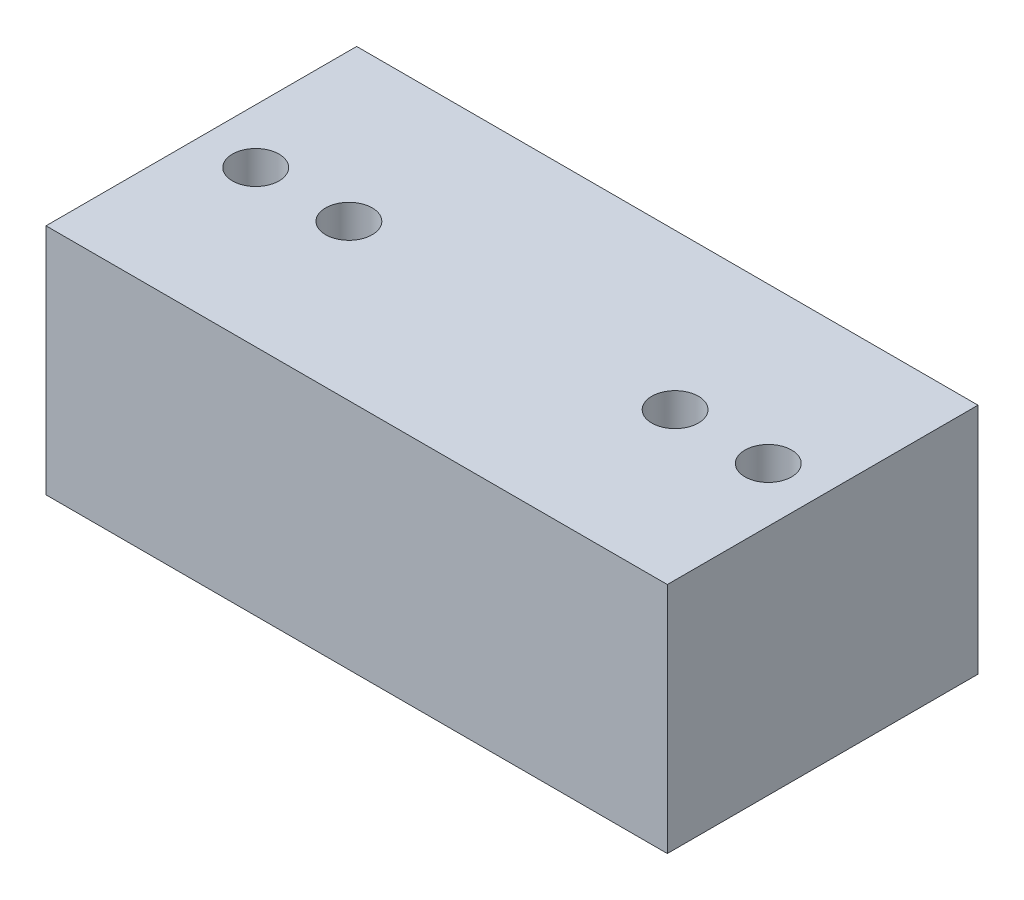
ISO-10303-21;
HEADER;
FILE_DESCRIPTION(('STEP AP214'),'2;1');
FILE_NAME('part.step','',(''),(''),'','','');
FILE_SCHEMA(('AUTOMOTIVE_DESIGN { 1 0 10303 214 1 1 1 1 }'));
ENDSEC;
DATA;
#1=APPLICATION_CONTEXT('core data for automotive mechanical design processes');
#2=APPLICATION_PROTOCOL_DEFINITION('international standard','automotive_design',2000,#1);
#3=PRODUCT_CONTEXT('',#1,'mechanical');
#4=PRODUCT('Part','Part','',(#3));
#5=PRODUCT_RELATED_PRODUCT_CATEGORY('part','',(#4));
#6=PRODUCT_DEFINITION_FORMATION('','',#4);
#7=PRODUCT_DEFINITION_CONTEXT('part definition',#1,'design');
#8=PRODUCT_DEFINITION('design','',#6,#7);
#9=PRODUCT_DEFINITION_SHAPE('','',#8);
#10=(LENGTH_UNIT() NAMED_UNIT(*) SI_UNIT(.MILLI.,.METRE.));
#11=(NAMED_UNIT(*) PLANE_ANGLE_UNIT() SI_UNIT($,.RADIAN.));
#12=(NAMED_UNIT(*) SI_UNIT($,.STERADIAN.) SOLID_ANGLE_UNIT());
#13=UNCERTAINTY_MEASURE_WITH_UNIT(LENGTH_MEASURE(1.E-05),#10,'distance_accuracy_value','');
#14=(GEOMETRIC_REPRESENTATION_CONTEXT(3) GLOBAL_UNCERTAINTY_ASSIGNED_CONTEXT((#13)) GLOBAL_UNIT_ASSIGNED_CONTEXT((#10,
#11,#12)) REPRESENTATION_CONTEXT('',''));
#15=CARTESIAN_POINT('',(0.,0.,0.));
#16=DIRECTION('',(0.,0.,1.));
#17=DIRECTION('',(1.,0.,0.));
#18=AXIS2_PLACEMENT_3D('',#15,#16,#17);
#19=CARTESIAN_POINT('',(-40.,30.,8.89945260731777));
#20=DIRECTION('',(0.,1.,0.));
#21=DIRECTION('',(0.,0.,1.));
#22=AXIS2_PLACEMENT_3D('',#19,#20,#21);
#23=PLANE('',#22);
#24=CARTESIAN_POINT('',(21.,30.,-11.1005473926822));
#25=DIRECTION('',(0.,1.,0.));
#26=DIRECTION('',(0.,0.,-1.));
#27=AXIS2_PLACEMENT_3D('',#24,#25,#26);
#28=CIRCLE('',#27,3.);
#29=CARTESIAN_POINT('',(21.,30.,-14.1005473926822));
#30=VERTEX_POINT('',#29);
#31=EDGE_CURVE('E129',#30,#30,#28,.T.);
#32=ORIENTED_EDGE('',*,*,#31,.F.);
#33=EDGE_LOOP('',(#32));
#34=FACE_BOUND('',#33,.T.);
#35=CARTESIAN_POINT('',(-21.,30.,-11.1005473926822));
#36=DIRECTION('',(0.,1.,0.));
#37=DIRECTION('',(0.,0.,1.));
#38=AXIS2_PLACEMENT_3D('',#35,#36,#37);
#39=CIRCLE('',#38,3.);
#40=CARTESIAN_POINT('',(-21.,30.,-8.10054739268222));
#41=VERTEX_POINT('',#40);
#42=EDGE_CURVE('E123',#41,#41,#39,.T.);
#43=ORIENTED_EDGE('',*,*,#42,.F.);
#44=EDGE_LOOP('',(#43));
#45=FACE_BOUND('',#44,.T.);
#46=CARTESIAN_POINT('',(-33.,30.,-11.1005473926822));
#47=DIRECTION('',(0.,1.,0.));
#48=DIRECTION('',(0.,0.,1.));
#49=AXIS2_PLACEMENT_3D('',#46,#47,#48);
#50=CIRCLE('',#49,3.);
#51=CARTESIAN_POINT('',(-33.,30.,-8.10054739268223));
#52=VERTEX_POINT('',#51);
#53=EDGE_CURVE('E99',#52,#52,#50,.T.);
#54=ORIENTED_EDGE('',*,*,#53,.F.);
#55=EDGE_LOOP('',(#54));
#56=FACE_BOUND('',#55,.T.);
#57=DIRECTION('',(0.,0.,1.));
#58=VECTOR('',#57,1.);
#59=CARTESIAN_POINT('',(-40.,30.,-31.1005473926822));
#60=LINE('',#59,#58);
#61=CARTESIAN_POINT('',(-40.,30.,-31.1005473926822));
#62=VERTEX_POINT('',#61);
#63=CARTESIAN_POINT('',(-40.,30.,8.89945260731777));
#64=VERTEX_POINT('',#63);
#65=EDGE_CURVE('E84',#62,#64,#60,.T.);
#66=ORIENTED_EDGE('',*,*,#65,.T.);
#67=DIRECTION('',(1.,0.,0.));
#68=VECTOR('',#67,1.);
#69=CARTESIAN_POINT('',(-40.,30.,8.89945260731777));
#70=LINE('',#69,#68);
#71=CARTESIAN_POINT('',(40.,30.,8.89945260731777));
#72=VERTEX_POINT('',#71);
#73=EDGE_CURVE('E79',#64,#72,#70,.T.);
#74=ORIENTED_EDGE('',*,*,#73,.T.);
#75=DIRECTION('',(0.,0.,-1.));
#76=VECTOR('',#75,1.);
#77=CARTESIAN_POINT('',(40.,30.,-31.1005473926822));
#78=LINE('',#77,#76);
#79=CARTESIAN_POINT('',(40.,30.,-31.1005473926822));
#80=VERTEX_POINT('',#79);
#81=EDGE_CURVE('E82',#72,#80,#78,.T.);
#82=ORIENTED_EDGE('',*,*,#81,.T.);
#83=DIRECTION('',(-1.,0.,0.));
#84=VECTOR('',#83,1.);
#85=CARTESIAN_POINT('',(-40.,30.,-31.1005473926822));
#86=LINE('',#85,#84);
#87=EDGE_CURVE('E49',#80,#62,#86,.T.);
#88=ORIENTED_EDGE('',*,*,#87,.T.);
#89=EDGE_LOOP('',(#66,#74,#82,#88));
#90=FACE_BOUND('',#89,.T.);
#91=CARTESIAN_POINT('',(33.,30.,-11.1005473926822));
#92=DIRECTION('',(0.,1.,0.));
#93=DIRECTION('',(0.,0.,-1.));
#94=AXIS2_PLACEMENT_3D('',#91,#92,#93);
#95=CIRCLE('',#94,3.);
#96=CARTESIAN_POINT('',(33.,30.,-14.1005473926822));
#97=VERTEX_POINT('',#96);
#98=EDGE_CURVE('E114',#97,#97,#95,.T.);
#99=ORIENTED_EDGE('',*,*,#98,.F.);
#100=EDGE_LOOP('',(#99));
#101=FACE_BOUND('',#100,.T.);
#102=ADVANCED_FACE('F32',(#34,#45,#56,#90,#101),#23,.T.);
#103=CARTESIAN_POINT('',(-40.,0.,8.89945260731777));
#104=DIRECTION('',(0.,1.,0.));
#105=DIRECTION('',(0.,0.,1.));
#106=AXIS2_PLACEMENT_3D('',#103,#104,#105);
#107=PLANE('',#106);
#108=CARTESIAN_POINT('',(-33.,0.,-11.1005473926822));
#109=DIRECTION('',(0.,1.,0.));
#110=DIRECTION('',(0.,0.,1.));
#111=AXIS2_PLACEMENT_3D('',#108,#109,#110);
#112=CIRCLE('',#111,3.);
#113=CARTESIAN_POINT('',(-33.,0.,-8.10054739268223));
#114=VERTEX_POINT('',#113);
#115=EDGE_CURVE('E111',#114,#114,#112,.T.);
#116=ORIENTED_EDGE('',*,*,#115,.T.);
#117=EDGE_LOOP('',(#116));
#118=FACE_BOUND('',#117,.T.);
#119=DIRECTION('',(0.,0.,1.));
#120=VECTOR('',#119,1.);
#121=CARTESIAN_POINT('',(-40.,0.,-31.1005473926822));
#122=LINE('',#121,#120);
#123=CARTESIAN_POINT('',(-40.,0.,-31.1005473926822));
#124=VERTEX_POINT('',#123);
#125=CARTESIAN_POINT('',(-40.,0.,8.89945260731777));
#126=VERTEX_POINT('',#125);
#127=EDGE_CURVE('E96',#124,#126,#122,.T.);
#128=ORIENTED_EDGE('',*,*,#127,.F.);
#129=DIRECTION('',(-1.,0.,0.));
#130=VECTOR('',#129,1.);
#131=CARTESIAN_POINT('',(-40.,0.,-31.1005473926822));
#132=LINE('',#131,#130);
#133=CARTESIAN_POINT('',(40.,0.,-31.1005473926822));
#134=VERTEX_POINT('',#133);
#135=EDGE_CURVE('E72',#134,#124,#132,.T.);
#136=ORIENTED_EDGE('',*,*,#135,.F.);
#137=DIRECTION('',(0.,0.,-1.));
#138=VECTOR('',#137,1.);
#139=CARTESIAN_POINT('',(40.,0.,-31.1005473926822));
#140=LINE('',#139,#138);
#141=CARTESIAN_POINT('',(40.,0.,8.89945260731777));
#142=VERTEX_POINT('',#141);
#143=EDGE_CURVE('E66',#142,#134,#140,.T.);
#144=ORIENTED_EDGE('',*,*,#143,.F.);
#145=DIRECTION('',(1.,0.,0.));
#146=VECTOR('',#145,1.);
#147=CARTESIAN_POINT('',(-40.,0.,8.89945260731777));
#148=LINE('',#147,#146);
#149=EDGE_CURVE('E88',#126,#142,#148,.T.);
#150=ORIENTED_EDGE('',*,*,#149,.F.);
#151=EDGE_LOOP('',(#128,#136,#144,#150));
#152=FACE_BOUND('',#151,.T.);
#153=CARTESIAN_POINT('',(33.,0.,-11.1005473926822));
#154=DIRECTION('',(0.,1.,0.));
#155=DIRECTION('',(0.,0.,-1.));
#156=AXIS2_PLACEMENT_3D('',#153,#154,#155);
#157=CIRCLE('',#156,3.);
#158=CARTESIAN_POINT('',(33.,0.,-14.1005473926822));
#159=VERTEX_POINT('',#158);
#160=EDGE_CURVE('E117',#159,#159,#157,.T.);
#161=ORIENTED_EDGE('',*,*,#160,.T.);
#162=EDGE_LOOP('',(#161));
#163=FACE_BOUND('',#162,.T.);
#164=ADVANCED_FACE('F107',(#118,#152,#163),#107,.F.);
#165=CARTESIAN_POINT('',(-40.,30.,-31.1005473926822));
#166=DIRECTION('',(1.,0.,0.));
#167=DIRECTION('',(0.,0.,-1.));
#168=AXIS2_PLACEMENT_3D('',#165,#166,#167);
#169=PLANE('',#168);
#170=ORIENTED_EDGE('',*,*,#127,.T.);
#171=DIRECTION('',(0.,-1.,0.));
#172=VECTOR('',#171,1.);
#173=CARTESIAN_POINT('',(-40.,30.,8.89945260731777));
#174=LINE('',#173,#172);
#175=EDGE_CURVE('E11',#64,#126,#174,.T.);
#176=ORIENTED_EDGE('',*,*,#175,.F.);
#177=ORIENTED_EDGE('',*,*,#65,.F.);
#178=DIRECTION('',(0.,-1.,0.));
#179=VECTOR('',#178,1.);
#180=CARTESIAN_POINT('',(-40.,30.,-31.1005473926822));
#181=LINE('',#180,#179);
#182=EDGE_CURVE('E92',#62,#124,#181,.T.);
#183=ORIENTED_EDGE('',*,*,#182,.T.);
#184=EDGE_LOOP('',(#170,#176,#177,#183));
#185=FACE_BOUND('',#184,.T.);
#186=ADVANCED_FACE('F34',(#185),#169,.F.);
#187=CARTESIAN_POINT('',(-40.,30.,8.89945260731777));
#188=DIRECTION('',(0.,0.,-1.));
#189=DIRECTION('',(-1.,0.,0.));
#190=AXIS2_PLACEMENT_3D('',#187,#188,#189);
#191=PLANE('',#190);
#192=ORIENTED_EDGE('',*,*,#149,.T.);
#193=DIRECTION('',(0.,-1.,0.));
#194=VECTOR('',#193,1.);
#195=CARTESIAN_POINT('',(40.,30.,8.89945260731777));
#196=LINE('',#195,#194);
#197=EDGE_CURVE('E41',#72,#142,#196,.T.);
#198=ORIENTED_EDGE('',*,*,#197,.F.);
#199=ORIENTED_EDGE('',*,*,#73,.F.);
#200=ORIENTED_EDGE('',*,*,#175,.T.);
#201=EDGE_LOOP('',(#192,#198,#199,#200));
#202=FACE_BOUND('',#201,.T.);
#203=ADVANCED_FACE('F87',(#202),#191,.F.);
#204=CARTESIAN_POINT('',(40.,30.,-31.1005473926822));
#205=DIRECTION('',(-1.,0.,0.));
#206=DIRECTION('',(0.,0.,1.));
#207=AXIS2_PLACEMENT_3D('',#204,#205,#206);
#208=PLANE('',#207);
#209=ORIENTED_EDGE('',*,*,#143,.T.);
#210=DIRECTION('',(0.,-1.,0.));
#211=VECTOR('',#210,1.);
#212=CARTESIAN_POINT('',(40.,30.,-31.1005473926822));
#213=LINE('',#212,#211);
#214=EDGE_CURVE('E89',#80,#134,#213,.T.);
#215=ORIENTED_EDGE('',*,*,#214,.F.);
#216=ORIENTED_EDGE('',*,*,#81,.F.);
#217=ORIENTED_EDGE('',*,*,#197,.T.);
#218=EDGE_LOOP('',(#209,#215,#216,#217));
#219=FACE_BOUND('',#218,.T.);
#220=ADVANCED_FACE('F90',(#219),#208,.F.);
#221=CARTESIAN_POINT('',(-40.,30.,-31.1005473926822));
#222=DIRECTION('',(0.,0.,1.));
#223=DIRECTION('',(1.,0.,0.));
#224=AXIS2_PLACEMENT_3D('',#221,#222,#223);
#225=PLANE('',#224);
#226=ORIENTED_EDGE('',*,*,#135,.T.);
#227=ORIENTED_EDGE('',*,*,#182,.F.);
#228=ORIENTED_EDGE('',*,*,#87,.F.);
#229=ORIENTED_EDGE('',*,*,#214,.T.);
#230=EDGE_LOOP('',(#226,#227,#228,#229));
#231=FACE_BOUND('',#230,.T.);
#232=ADVANCED_FACE('F104',(#231),#225,.F.);
#233=CARTESIAN_POINT('',(-33.,30.,-11.1005473926822));
#234=DIRECTION('',(0.,-1.,0.));
#235=DIRECTION('',(0.,0.,-1.));
#236=AXIS2_PLACEMENT_3D('',#233,#234,#235);
#237=CYLINDRICAL_SURFACE('',#236,3.);
#238=ORIENTED_EDGE('',*,*,#53,.T.);
#239=EDGE_LOOP('',(#238));
#240=FACE_BOUND('',#239,.T.);
#241=ORIENTED_EDGE('',*,*,#115,.F.);
#242=EDGE_LOOP('',(#241));
#243=FACE_BOUND('',#242,.T.);
#244=ADVANCED_FACE('F151',(#240,#243),#237,.F.);
#245=CARTESIAN_POINT('',(33.,30.,-11.1005473926822));
#246=DIRECTION('',(0.,-1.,0.));
#247=DIRECTION('',(0.,0.,-1.));
#248=AXIS2_PLACEMENT_3D('',#245,#246,#247);
#249=CYLINDRICAL_SURFACE('',#248,3.);
#250=ORIENTED_EDGE('',*,*,#98,.T.);
#251=EDGE_LOOP('',(#250));
#252=FACE_BOUND('',#251,.T.);
#253=ORIENTED_EDGE('',*,*,#160,.F.);
#254=EDGE_LOOP('',(#253));
#255=FACE_BOUND('',#254,.T.);
#256=ADVANCED_FACE('F154',(#252,#255),#249,.F.);
#257=CARTESIAN_POINT('',(-21.,15.,-11.1005473926822));
#258=DIRECTION('',(0.,1.,0.));
#259=DIRECTION('',(0.,0.,1.));
#260=AXIS2_PLACEMENT_3D('',#257,#258,#259);
#261=CYLINDRICAL_SURFACE('',#260,3.);
#262=CARTESIAN_POINT('',(-21.,15.,-11.1005473926822));
#263=DIRECTION('',(0.,1.,0.));
#264=DIRECTION('',(0.,0.,1.));
#265=AXIS2_PLACEMENT_3D('',#262,#263,#264);
#266=CIRCLE('',#265,3.);
#267=CARTESIAN_POINT('',(-21.,15.,-8.10054739268222));
#268=VERTEX_POINT('',#267);
#269=EDGE_CURVE('E120',#268,#268,#266,.T.);
#270=ORIENTED_EDGE('',*,*,#269,.F.);
#271=EDGE_LOOP('',(#270));
#272=FACE_BOUND('',#271,.T.);
#273=ORIENTED_EDGE('',*,*,#42,.T.);
#274=EDGE_LOOP('',(#273));
#275=FACE_BOUND('',#274,.T.);
#276=ADVANCED_FACE('F190',(#272,#275),#261,.F.);
#277=CARTESIAN_POINT('',(-21.,15.,-11.1005473926822));
#278=DIRECTION('',(0.,1.,0.));
#279=DIRECTION('',(0.,0.,1.));
#280=AXIS2_PLACEMENT_3D('',#277,#278,#279);
#281=PLANE('',#280);
#282=ORIENTED_EDGE('',*,*,#269,.T.);
#283=EDGE_LOOP('',(#282));
#284=FACE_BOUND('',#283,.T.);
#285=ADVANCED_FACE('F140',(#284),#281,.T.);
#286=CARTESIAN_POINT('',(21.,15.,-11.1005473926822));
#287=DIRECTION('',(0.,1.,0.));
#288=DIRECTION('',(0.,0.,1.));
#289=AXIS2_PLACEMENT_3D('',#286,#287,#288);
#290=CYLINDRICAL_SURFACE('',#289,3.);
#291=CARTESIAN_POINT('',(21.,15.,-11.1005473926822));
#292=DIRECTION('',(0.,1.,0.));
#293=DIRECTION('',(0.,0.,-1.));
#294=AXIS2_PLACEMENT_3D('',#291,#292,#293);
#295=CIRCLE('',#294,3.);
#296=CARTESIAN_POINT('',(21.,15.,-14.1005473926822));
#297=VERTEX_POINT('',#296);
#298=EDGE_CURVE('E126',#297,#297,#295,.T.);
#299=ORIENTED_EDGE('',*,*,#298,.F.);
#300=EDGE_LOOP('',(#299));
#301=FACE_BOUND('',#300,.T.);
#302=ORIENTED_EDGE('',*,*,#31,.T.);
#303=EDGE_LOOP('',(#302));
#304=FACE_BOUND('',#303,.T.);
#305=ADVANCED_FACE('F137',(#301,#304),#290,.F.);
#306=CARTESIAN_POINT('',(21.,15.,-11.1005473926822));
#307=DIRECTION('',(0.,-1.,0.));
#308=DIRECTION('',(0.,0.,-1.));
#309=AXIS2_PLACEMENT_3D('',#306,#307,#308);
#310=PLANE('',#309);
#311=ORIENTED_EDGE('',*,*,#298,.T.);
#312=EDGE_LOOP('',(#311));
#313=FACE_BOUND('',#312,.T.);
#314=ADVANCED_FACE('F135',(#313),#310,.F.);
#315=CLOSED_SHELL('',(#102,#164,#186,#203,#220,#232,#244,#256,#276,#285,#305,#314));
#316=MANIFOLD_SOLID_BREP('B2',#315);
#317=ADVANCED_BREP_SHAPE_REPRESENTATION('',(#18,#316),#14);
#318=SHAPE_DEFINITION_REPRESENTATION(#9,#317);
ENDSEC;
END-ISO-10303-21;
